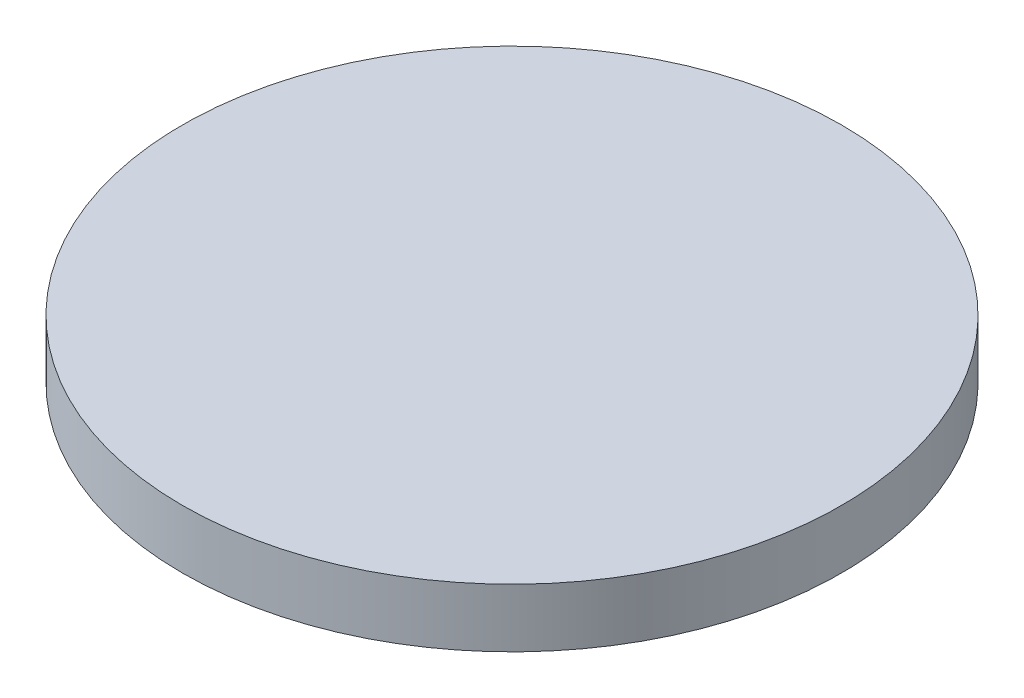
ISO-10303-21;
HEADER;
FILE_DESCRIPTION(('STEP AP214'),'2;1');
FILE_NAME('part.step','',(''),(''),'','','');
FILE_SCHEMA(('AUTOMOTIVE_DESIGN { 1 0 10303 214 1 1 1 1 }'));
ENDSEC;
DATA;
#1=APPLICATION_CONTEXT('core data for automotive mechanical design processes');
#2=APPLICATION_PROTOCOL_DEFINITION('international standard','automotive_design',2000,#1);
#3=PRODUCT_CONTEXT('',#1,'mechanical');
#4=PRODUCT('Part','Part','',(#3));
#5=PRODUCT_RELATED_PRODUCT_CATEGORY('part','',(#4));
#6=PRODUCT_DEFINITION_FORMATION('','',#4);
#7=PRODUCT_DEFINITION_CONTEXT('part definition',#1,'design');
#8=PRODUCT_DEFINITION('design','',#6,#7);
#9=PRODUCT_DEFINITION_SHAPE('','',#8);
#10=(LENGTH_UNIT() NAMED_UNIT(*) SI_UNIT(.MILLI.,.METRE.));
#11=(NAMED_UNIT(*) PLANE_ANGLE_UNIT() SI_UNIT($,.RADIAN.));
#12=(NAMED_UNIT(*) SI_UNIT($,.STERADIAN.) SOLID_ANGLE_UNIT());
#13=UNCERTAINTY_MEASURE_WITH_UNIT(LENGTH_MEASURE(1.E-05),#10,'distance_accuracy_value','');
#14=(GEOMETRIC_REPRESENTATION_CONTEXT(3) GLOBAL_UNCERTAINTY_ASSIGNED_CONTEXT((#13)) GLOBAL_UNIT_ASSIGNED_CONTEXT((#10,
#11,#12)) REPRESENTATION_CONTEXT('',''));
#15=CARTESIAN_POINT('',(0.,0.,0.));
#16=DIRECTION('',(0.,0.,1.));
#17=DIRECTION('',(1.,0.,0.));
#18=AXIS2_PLACEMENT_3D('',#15,#16,#17);
#19=CARTESIAN_POINT('',(0.,4.,0.));
#20=DIRECTION('',(0.,-1.,0.));
#21=DIRECTION('',(0.,0.,-1.));
#22=AXIS2_PLACEMENT_3D('',#19,#20,#21);
#23=CYLINDRICAL_SURFACE('',#22,22.5);
#24=CARTESIAN_POINT('',(0.,4.,0.));
#25=DIRECTION('',(0.,1.,0.));
#26=DIRECTION('',(0.,0.,1.));
#27=AXIS2_PLACEMENT_3D('',#24,#25,#26);
#28=CIRCLE('',#27,22.5);
#29=CARTESIAN_POINT('',(0.,4.,22.5));
#30=VERTEX_POINT('',#29);
#31=EDGE_CURVE('E10',#30,#30,#28,.T.);
#32=ORIENTED_EDGE('',*,*,#31,.F.);
#33=EDGE_LOOP('',(#32));
#34=FACE_BOUND('',#33,.T.);
#35=CARTESIAN_POINT('',(0.,0.,0.));
#36=DIRECTION('',(0.,1.,0.));
#37=DIRECTION('',(0.,0.,1.));
#38=AXIS2_PLACEMENT_3D('',#35,#36,#37);
#39=CIRCLE('',#38,22.5);
#40=CARTESIAN_POINT('',(0.,0.,22.5));
#41=VERTEX_POINT('',#40);
#42=EDGE_CURVE('E33',#41,#41,#39,.T.);
#43=ORIENTED_EDGE('',*,*,#42,.T.);
#44=EDGE_LOOP('',(#43));
#45=FACE_BOUND('',#44,.T.);
#46=ADVANCED_FACE('F30',(#34,#45),#23,.T.);
#47=CARTESIAN_POINT('',(0.,4.,0.));
#48=DIRECTION('',(0.,1.,0.));
#49=DIRECTION('',(0.,0.,1.));
#50=AXIS2_PLACEMENT_3D('',#47,#48,#49);
#51=PLANE('',#50);
#52=ORIENTED_EDGE('',*,*,#31,.T.);
#53=EDGE_LOOP('',(#52));
#54=FACE_BOUND('',#53,.T.);
#55=ADVANCED_FACE('F45',(#54),#51,.T.);
#56=CARTESIAN_POINT('',(0.,0.,0.));
#57=DIRECTION('',(0.,1.,0.));
#58=DIRECTION('',(0.,0.,1.));
#59=AXIS2_PLACEMENT_3D('',#56,#57,#58);
#60=PLANE('',#59);
#61=ORIENTED_EDGE('',*,*,#42,.F.);
#62=EDGE_LOOP('',(#61));
#63=FACE_BOUND('',#62,.T.);
#64=ADVANCED_FACE('F43',(#63),#60,.F.);
#65=CLOSED_SHELL('',(#46,#55,#64));
#66=MANIFOLD_SOLID_BREP('B2',#65);
#67=ADVANCED_BREP_SHAPE_REPRESENTATION('',(#18,#66),#14);
#68=SHAPE_DEFINITION_REPRESENTATION(#9,#67);
ENDSEC;
END-ISO-10303-21;
